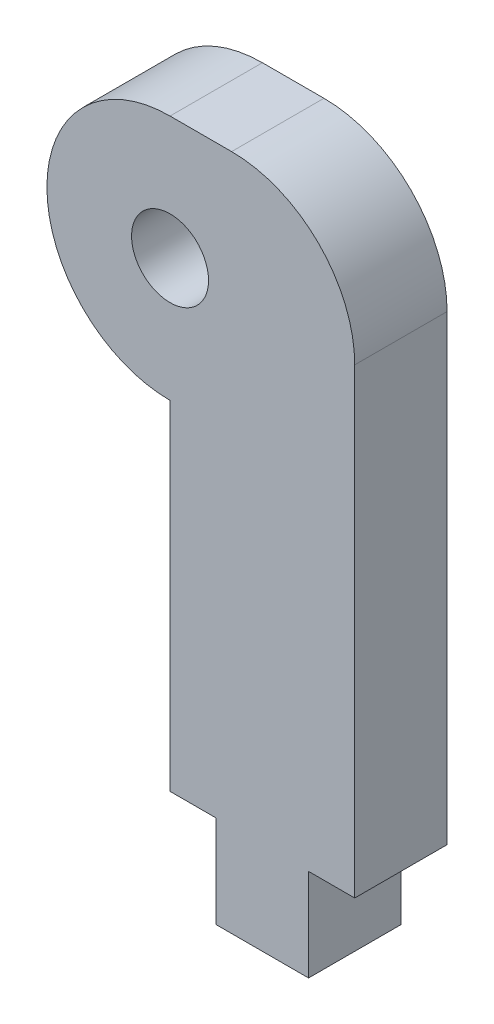
ISO-10303-21;
HEADER;
FILE_DESCRIPTION(('STEP AP214'),'2;1');
FILE_NAME('part.step','',(''),(''),'','','');
FILE_SCHEMA(('AUTOMOTIVE_DESIGN { 1 0 10303 214 1 1 1 1 }'));
ENDSEC;
DATA;
#1=APPLICATION_CONTEXT('core data for automotive mechanical design processes');
#2=APPLICATION_PROTOCOL_DEFINITION('international standard','automotive_design',2000,#1);
#3=PRODUCT_CONTEXT('',#1,'mechanical');
#4=PRODUCT('Part','Part','',(#3));
#5=PRODUCT_RELATED_PRODUCT_CATEGORY('part','',(#4));
#6=PRODUCT_DEFINITION_FORMATION('','',#4);
#7=PRODUCT_DEFINITION_CONTEXT('part definition',#1,'design');
#8=PRODUCT_DEFINITION('design','',#6,#7);
#9=PRODUCT_DEFINITION_SHAPE('','',#8);
#10=(LENGTH_UNIT() NAMED_UNIT(*) SI_UNIT(.MILLI.,.METRE.));
#11=(NAMED_UNIT(*) PLANE_ANGLE_UNIT() SI_UNIT($,.RADIAN.));
#12=(NAMED_UNIT(*) SI_UNIT($,.STERADIAN.) SOLID_ANGLE_UNIT());
#13=UNCERTAINTY_MEASURE_WITH_UNIT(LENGTH_MEASURE(1.E-05),#10,'distance_accuracy_value','');
#14=(GEOMETRIC_REPRESENTATION_CONTEXT(3) GLOBAL_UNCERTAINTY_ASSIGNED_CONTEXT((#13)) GLOBAL_UNIT_ASSIGNED_CONTEXT((#10,
#11,#12)) REPRESENTATION_CONTEXT('',''));
#15=CARTESIAN_POINT('',(0.,0.,0.));
#16=DIRECTION('',(0.,0.,1.));
#17=DIRECTION('',(1.,0.,0.));
#18=AXIS2_PLACEMENT_3D('',#15,#16,#17);
#19=CARTESIAN_POINT('',(0.,0.,3.));
#20=DIRECTION('',(0.,0.,1.));
#21=DIRECTION('',(1.,0.,0.));
#22=AXIS2_PLACEMENT_3D('',#19,#20,#21);
#23=PLANE('',#22);
#24=DIRECTION('',(0.,1.,0.));
#25=VECTOR('',#24,1.);
#26=CARTESIAN_POINT('',(6.,4.,3.));
#27=LINE('',#26,#25);
#28=CARTESIAN_POINT('',(6.00000000000001,-15.,3.));
#29=VERTEX_POINT('',#28);
#30=CARTESIAN_POINT('',(6.,0.,3.));
#31=VERTEX_POINT('',#30);
#32=EDGE_CURVE('E106',#29,#31,#27,.T.);
#33=ORIENTED_EDGE('',*,*,#32,.T.);
#34=CARTESIAN_POINT('',(2.,0.,3.));
#35=DIRECTION('',(0.,0.,1.));
#36=DIRECTION('',(1.,0.,0.));
#37=AXIS2_PLACEMENT_3D('',#34,#35,#36);
#38=CIRCLE('',#37,4.);
#39=CARTESIAN_POINT('',(2.,4.,3.));
#40=VERTEX_POINT('',#39);
#41=EDGE_CURVE('E11',#31,#40,#38,.T.);
#42=ORIENTED_EDGE('',*,*,#41,.T.);
#43=DIRECTION('',(-1.,0.,0.));
#44=VECTOR('',#43,1.);
#45=CARTESIAN_POINT('',(0.,4.,3.));
#46=LINE('',#45,#44);
#47=CARTESIAN_POINT('',(0.,4.,3.));
#48=VERTEX_POINT('',#47);
#49=EDGE_CURVE('E114',#40,#48,#46,.T.);
#50=ORIENTED_EDGE('',*,*,#49,.T.);
#51=CARTESIAN_POINT('',(0.,0.,3.));
#52=DIRECTION('',(0.,0.,1.));
#53=DIRECTION('',(1.,0.,0.));
#54=AXIS2_PLACEMENT_3D('',#51,#52,#53);
#55=CIRCLE('',#54,4.);
#56=CARTESIAN_POINT('',(0.,-4.,3.));
#57=VERTEX_POINT('',#56);
#58=EDGE_CURVE('E181',#48,#57,#55,.T.);
#59=ORIENTED_EDGE('',*,*,#58,.T.);
#60=DIRECTION('',(0.,-1.,0.));
#61=VECTOR('',#60,1.);
#62=CARTESIAN_POINT('',(0.,-15.,3.));
#63=LINE('',#62,#61);
#64=CARTESIAN_POINT('',(0.,-15.,3.));
#65=VERTEX_POINT('',#64);
#66=EDGE_CURVE('E179',#57,#65,#63,.T.);
#67=ORIENTED_EDGE('',*,*,#66,.T.);
#68=DIRECTION('',(1.,0.,0.));
#69=VECTOR('',#68,1.);
#70=CARTESIAN_POINT('',(1.50000000000001,-15.,3.));
#71=LINE('',#70,#69);
#72=CARTESIAN_POINT('',(1.50000000000001,-15.,3.));
#73=VERTEX_POINT('',#72);
#74=EDGE_CURVE('E177',#65,#73,#71,.T.);
#75=ORIENTED_EDGE('',*,*,#74,.T.);
#76=DIRECTION('',(0.,-1.,0.));
#77=VECTOR('',#76,1.);
#78=CARTESIAN_POINT('',(1.50000000000001,-18.,3.));
#79=LINE('',#78,#77);
#80=CARTESIAN_POINT('',(1.50000000000001,-18.,3.));
#81=VERTEX_POINT('',#80);
#82=EDGE_CURVE('E175',#73,#81,#79,.T.);
#83=ORIENTED_EDGE('',*,*,#82,.T.);
#84=DIRECTION('',(1.,0.,0.));
#85=VECTOR('',#84,1.);
#86=CARTESIAN_POINT('',(4.50000000000001,-18.,3.));
#87=LINE('',#86,#85);
#88=CARTESIAN_POINT('',(4.50000000000001,-18.,3.));
#89=VERTEX_POINT('',#88);
#90=EDGE_CURVE('E173',#81,#89,#87,.T.);
#91=ORIENTED_EDGE('',*,*,#90,.T.);
#92=DIRECTION('',(0.,1.,0.));
#93=VECTOR('',#92,1.);
#94=CARTESIAN_POINT('',(4.50000000000001,-15.,3.));
#95=LINE('',#94,#93);
#96=CARTESIAN_POINT('',(4.50000000000001,-15.,3.));
#97=VERTEX_POINT('',#96);
#98=EDGE_CURVE('E120',#89,#97,#95,.T.);
#99=ORIENTED_EDGE('',*,*,#98,.T.);
#100=DIRECTION('',(1.,0.,0.));
#101=VECTOR('',#100,1.);
#102=CARTESIAN_POINT('',(6.00000000000001,-15.,3.));
#103=LINE('',#102,#101);
#104=EDGE_CURVE('E115',#97,#29,#103,.T.);
#105=ORIENTED_EDGE('',*,*,#104,.T.);
#106=EDGE_LOOP('',(#33,#42,#50,#59,#67,#75,#83,#91,#99,#105));
#107=FACE_BOUND('',#106,.T.);
#108=CARTESIAN_POINT('',(0.,0.,3.));
#109=DIRECTION('',(0.,0.,1.));
#110=DIRECTION('',(1.,0.,0.));
#111=AXIS2_PLACEMENT_3D('',#108,#109,#110);
#112=CIRCLE('',#111,1.25);
#113=CARTESIAN_POINT('',(1.25,0.,3.));
#114=VERTEX_POINT('',#113);
#115=EDGE_CURVE('E171',#114,#114,#112,.T.);
#116=ORIENTED_EDGE('',*,*,#115,.F.);
#117=EDGE_LOOP('',(#116));
#118=FACE_BOUND('',#117,.T.);
#119=ADVANCED_FACE('F33',(#107,#118),#23,.T.);
#120=CARTESIAN_POINT('',(0.,0.,0.));
#121=DIRECTION('',(0.,0.,1.));
#122=DIRECTION('',(1.,0.,0.));
#123=AXIS2_PLACEMENT_3D('',#120,#121,#122);
#124=PLANE('',#123);
#125=DIRECTION('',(-1.,0.,0.));
#126=VECTOR('',#125,1.);
#127=CARTESIAN_POINT('',(0.,4.,0.));
#128=LINE('',#127,#126);
#129=CARTESIAN_POINT('',(2.,4.,0.));
#130=VERTEX_POINT('',#129);
#131=CARTESIAN_POINT('',(0.,4.,0.));
#132=VERTEX_POINT('',#131);
#133=EDGE_CURVE('E166',#130,#132,#128,.T.);
#134=ORIENTED_EDGE('',*,*,#133,.F.);
#135=CARTESIAN_POINT('',(2.,0.,0.));
#136=DIRECTION('',(0.,0.,1.));
#137=DIRECTION('',(1.,0.,0.));
#138=AXIS2_PLACEMENT_3D('',#135,#136,#137);
#139=CIRCLE('',#138,4.);
#140=CARTESIAN_POINT('',(6.,0.,0.));
#141=VERTEX_POINT('',#140);
#142=EDGE_CURVE('E55',#130,#141,#139,.F.);
#143=ORIENTED_EDGE('',*,*,#142,.T.);
#144=DIRECTION('',(0.,1.,0.));
#145=VECTOR('',#144,1.);
#146=CARTESIAN_POINT('',(6.,4.,0.));
#147=LINE('',#146,#145);
#148=CARTESIAN_POINT('',(6.00000000000001,-15.,0.));
#149=VERTEX_POINT('',#148);
#150=EDGE_CURVE('E168',#149,#141,#147,.T.);
#151=ORIENTED_EDGE('',*,*,#150,.F.);
#152=DIRECTION('',(1.,0.,0.));
#153=VECTOR('',#152,1.);
#154=CARTESIAN_POINT('',(6.00000000000001,-15.,0.));
#155=LINE('',#154,#153);
#156=CARTESIAN_POINT('',(4.50000000000001,-15.,0.));
#157=VERTEX_POINT('',#156);
#158=EDGE_CURVE('E128',#157,#149,#155,.T.);
#159=ORIENTED_EDGE('',*,*,#158,.F.);
#160=DIRECTION('',(0.,1.,0.));
#161=VECTOR('',#160,1.);
#162=CARTESIAN_POINT('',(4.50000000000001,-15.,0.));
#163=LINE('',#162,#161);
#164=CARTESIAN_POINT('',(4.50000000000001,-18.,0.));
#165=VERTEX_POINT('',#164);
#166=EDGE_CURVE('E124',#165,#157,#163,.T.);
#167=ORIENTED_EDGE('',*,*,#166,.F.);
#168=DIRECTION('',(1.,0.,0.));
#169=VECTOR('',#168,1.);
#170=CARTESIAN_POINT('',(4.50000000000001,-18.,0.));
#171=LINE('',#170,#169);
#172=CARTESIAN_POINT('',(1.50000000000001,-18.,0.));
#173=VERTEX_POINT('',#172);
#174=EDGE_CURVE('E156',#173,#165,#171,.T.);
#175=ORIENTED_EDGE('',*,*,#174,.F.);
#176=DIRECTION('',(0.,-1.,0.));
#177=VECTOR('',#176,1.);
#178=CARTESIAN_POINT('',(1.50000000000001,-18.,0.));
#179=LINE('',#178,#177);
#180=CARTESIAN_POINT('',(1.50000000000001,-15.,0.));
#181=VERTEX_POINT('',#180);
#182=EDGE_CURVE('E158',#181,#173,#179,.T.);
#183=ORIENTED_EDGE('',*,*,#182,.F.);
#184=DIRECTION('',(1.,0.,0.));
#185=VECTOR('',#184,1.);
#186=CARTESIAN_POINT('',(1.50000000000001,-15.,0.));
#187=LINE('',#186,#185);
#188=CARTESIAN_POINT('',(0.,-15.,0.));
#189=VERTEX_POINT('',#188);
#190=EDGE_CURVE('E160',#189,#181,#187,.T.);
#191=ORIENTED_EDGE('',*,*,#190,.F.);
#192=DIRECTION('',(0.,-1.,0.));
#193=VECTOR('',#192,1.);
#194=CARTESIAN_POINT('',(0.,-15.,0.));
#195=LINE('',#194,#193);
#196=CARTESIAN_POINT('',(0.,-4.,0.));
#197=VERTEX_POINT('',#196);
#198=EDGE_CURVE('E162',#197,#189,#195,.T.);
#199=ORIENTED_EDGE('',*,*,#198,.F.);
#200=CARTESIAN_POINT('',(0.,0.,0.));
#201=DIRECTION('',(0.,0.,1.));
#202=DIRECTION('',(1.,0.,0.));
#203=AXIS2_PLACEMENT_3D('',#200,#201,#202);
#204=CIRCLE('',#203,4.);
#205=EDGE_CURVE('E164',#132,#197,#204,.T.);
#206=ORIENTED_EDGE('',*,*,#205,.F.);
#207=EDGE_LOOP('',(#134,#143,#151,#159,#167,#175,#183,#191,#199,#206));
#208=FACE_BOUND('',#207,.T.);
#209=CARTESIAN_POINT('',(0.,0.,0.));
#210=DIRECTION('',(0.,0.,1.));
#211=DIRECTION('',(1.,0.,0.));
#212=AXIS2_PLACEMENT_3D('',#209,#210,#211);
#213=CIRCLE('',#212,1.25);
#214=CARTESIAN_POINT('',(1.25,0.,0.));
#215=VERTEX_POINT('',#214);
#216=EDGE_CURVE('E184',#215,#215,#213,.T.);
#217=ORIENTED_EDGE('',*,*,#216,.T.);
#218=EDGE_LOOP('',(#217));
#219=FACE_BOUND('',#218,.T.);
#220=ADVANCED_FACE('F193',(#208,#219),#124,.F.);
#221=CARTESIAN_POINT('',(6.00000000000001,-15.,3.));
#222=DIRECTION('',(0.,1.,0.));
#223=DIRECTION('',(-1.,0.,0.));
#224=AXIS2_PLACEMENT_3D('',#221,#222,#223);
#225=PLANE('',#224);
#226=ORIENTED_EDGE('',*,*,#158,.T.);
#227=DIRECTION('',(0.,0.,-1.));
#228=VECTOR('',#227,1.);
#229=CARTESIAN_POINT('',(6.00000000000001,-15.,3.));
#230=LINE('',#229,#228);
#231=EDGE_CURVE('E110',#29,#149,#230,.T.);
#232=ORIENTED_EDGE('',*,*,#231,.F.);
#233=ORIENTED_EDGE('',*,*,#104,.F.);
#234=DIRECTION('',(0.,0.,-1.));
#235=VECTOR('',#234,1.);
#236=CARTESIAN_POINT('',(4.50000000000001,-15.,3.));
#237=LINE('',#236,#235);
#238=EDGE_CURVE('E153',#97,#157,#237,.T.);
#239=ORIENTED_EDGE('',*,*,#238,.T.);
#240=EDGE_LOOP('',(#226,#232,#233,#239));
#241=FACE_BOUND('',#240,.T.);
#242=ADVANCED_FACE('F126',(#241),#225,.F.);
#243=CARTESIAN_POINT('',(6.,4.,3.));
#244=DIRECTION('',(-1.,0.,0.));
#245=DIRECTION('',(0.,-1.,0.));
#246=AXIS2_PLACEMENT_3D('',#243,#244,#245);
#247=PLANE('',#246);
#248=ORIENTED_EDGE('',*,*,#150,.T.);
#249=DIRECTION('',(0.,0.,-1.));
#250=VECTOR('',#249,1.);
#251=CARTESIAN_POINT('',(6.,0.,3.));
#252=LINE('',#251,#250);
#253=EDGE_CURVE('E41',#141,#31,#252,.F.);
#254=ORIENTED_EDGE('',*,*,#253,.T.);
#255=ORIENTED_EDGE('',*,*,#32,.F.);
#256=ORIENTED_EDGE('',*,*,#231,.T.);
#257=EDGE_LOOP('',(#248,#254,#255,#256));
#258=FACE_BOUND('',#257,.T.);
#259=ADVANCED_FACE('F108',(#258),#247,.F.);
#260=CARTESIAN_POINT('',(0.,4.,3.));
#261=DIRECTION('',(0.,-1.,0.));
#262=DIRECTION('',(0.,0.,-1.));
#263=AXIS2_PLACEMENT_3D('',#260,#261,#262);
#264=PLANE('',#263);
#265=ORIENTED_EDGE('',*,*,#49,.F.);
#266=DIRECTION('',(0.,0.,-1.));
#267=VECTOR('',#266,1.);
#268=CARTESIAN_POINT('',(2.,4.,3.));
#269=LINE('',#268,#267);
#270=EDGE_CURVE('E129',#40,#130,#269,.T.);
#271=ORIENTED_EDGE('',*,*,#270,.T.);
#272=ORIENTED_EDGE('',*,*,#133,.T.);
#273=DIRECTION('',(0.,0.,-1.));
#274=VECTOR('',#273,1.);
#275=CARTESIAN_POINT('',(0.,4.,3.));
#276=LINE('',#275,#274);
#277=EDGE_CURVE('E130',#48,#132,#276,.T.);
#278=ORIENTED_EDGE('',*,*,#277,.F.);
#279=EDGE_LOOP('',(#265,#271,#272,#278));
#280=FACE_BOUND('',#279,.T.);
#281=ADVANCED_FACE('F224',(#280),#264,.F.);
#282=CARTESIAN_POINT('',(0.,0.,3.));
#283=DIRECTION('',(0.,0.,-1.));
#284=DIRECTION('',(-1.,0.,0.));
#285=AXIS2_PLACEMENT_3D('',#282,#283,#284);
#286=CYLINDRICAL_SURFACE('',#285,4.);
#287=ORIENTED_EDGE('',*,*,#205,.T.);
#288=DIRECTION('',(0.,0.,-1.));
#289=VECTOR('',#288,1.);
#290=CARTESIAN_POINT('',(0.,-4.,3.));
#291=LINE('',#290,#289);
#292=EDGE_CURVE('E135',#57,#197,#291,.T.);
#293=ORIENTED_EDGE('',*,*,#292,.F.);
#294=ORIENTED_EDGE('',*,*,#58,.F.);
#295=ORIENTED_EDGE('',*,*,#277,.T.);
#296=EDGE_LOOP('',(#287,#293,#294,#295));
#297=FACE_BOUND('',#296,.T.);
#298=ADVANCED_FACE('F220',(#297),#286,.T.);
#299=CARTESIAN_POINT('',(0.,-15.,3.));
#300=DIRECTION('',(1.,0.,0.));
#301=DIRECTION('',(0.,1.,0.));
#302=AXIS2_PLACEMENT_3D('',#299,#300,#301);
#303=PLANE('',#302);
#304=ORIENTED_EDGE('',*,*,#198,.T.);
#305=DIRECTION('',(0.,0.,-1.));
#306=VECTOR('',#305,1.);
#307=CARTESIAN_POINT('',(0.,-15.,3.));
#308=LINE('',#307,#306);
#309=EDGE_CURVE('E141',#65,#189,#308,.T.);
#310=ORIENTED_EDGE('',*,*,#309,.F.);
#311=ORIENTED_EDGE('',*,*,#66,.F.);
#312=ORIENTED_EDGE('',*,*,#292,.T.);
#313=EDGE_LOOP('',(#304,#310,#311,#312));
#314=FACE_BOUND('',#313,.T.);
#315=ADVANCED_FACE('F216',(#314),#303,.F.);
#316=CARTESIAN_POINT('',(1.50000000000001,-15.,3.));
#317=DIRECTION('',(0.,1.,0.));
#318=DIRECTION('',(0.,0.,1.));
#319=AXIS2_PLACEMENT_3D('',#316,#317,#318);
#320=PLANE('',#319);
#321=ORIENTED_EDGE('',*,*,#190,.T.);
#322=DIRECTION('',(0.,0.,-1.));
#323=VECTOR('',#322,1.);
#324=CARTESIAN_POINT('',(1.50000000000001,-15.,3.));
#325=LINE('',#324,#323);
#326=EDGE_CURVE('E144',#73,#181,#325,.T.);
#327=ORIENTED_EDGE('',*,*,#326,.F.);
#328=ORIENTED_EDGE('',*,*,#74,.F.);
#329=ORIENTED_EDGE('',*,*,#309,.T.);
#330=EDGE_LOOP('',(#321,#327,#328,#329));
#331=FACE_BOUND('',#330,.T.);
#332=ADVANCED_FACE('F212',(#331),#320,.F.);
#333=CARTESIAN_POINT('',(1.50000000000001,-18.,3.));
#334=DIRECTION('',(1.,0.,0.));
#335=DIRECTION('',(0.,0.,-1.));
#336=AXIS2_PLACEMENT_3D('',#333,#334,#335);
#337=PLANE('',#336);
#338=ORIENTED_EDGE('',*,*,#182,.T.);
#339=DIRECTION('',(0.,0.,-1.));
#340=VECTOR('',#339,1.);
#341=CARTESIAN_POINT('',(1.50000000000001,-18.,3.));
#342=LINE('',#341,#340);
#343=EDGE_CURVE('E147',#81,#173,#342,.T.);
#344=ORIENTED_EDGE('',*,*,#343,.F.);
#345=ORIENTED_EDGE('',*,*,#82,.F.);
#346=ORIENTED_EDGE('',*,*,#326,.T.);
#347=EDGE_LOOP('',(#338,#344,#345,#346));
#348=FACE_BOUND('',#347,.T.);
#349=ADVANCED_FACE('F208',(#348),#337,.F.);
#350=CARTESIAN_POINT('',(4.50000000000001,-18.,3.));
#351=DIRECTION('',(0.,1.,0.));
#352=DIRECTION('',(0.,0.,1.));
#353=AXIS2_PLACEMENT_3D('',#350,#351,#352);
#354=PLANE('',#353);
#355=ORIENTED_EDGE('',*,*,#174,.T.);
#356=DIRECTION('',(0.,0.,-1.));
#357=VECTOR('',#356,1.);
#358=CARTESIAN_POINT('',(4.50000000000001,-18.,3.));
#359=LINE('',#358,#357);
#360=EDGE_CURVE('E150',#89,#165,#359,.T.);
#361=ORIENTED_EDGE('',*,*,#360,.F.);
#362=ORIENTED_EDGE('',*,*,#90,.F.);
#363=ORIENTED_EDGE('',*,*,#343,.T.);
#364=EDGE_LOOP('',(#355,#361,#362,#363));
#365=FACE_BOUND('',#364,.T.);
#366=ADVANCED_FACE('F204',(#365),#354,.F.);
#367=CARTESIAN_POINT('',(4.50000000000001,-15.,3.));
#368=DIRECTION('',(-1.,0.,0.));
#369=DIRECTION('',(0.,-1.,0.));
#370=AXIS2_PLACEMENT_3D('',#367,#368,#369);
#371=PLANE('',#370);
#372=ORIENTED_EDGE('',*,*,#166,.T.);
#373=ORIENTED_EDGE('',*,*,#238,.F.);
#374=ORIENTED_EDGE('',*,*,#98,.F.);
#375=ORIENTED_EDGE('',*,*,#360,.T.);
#376=EDGE_LOOP('',(#372,#373,#374,#375));
#377=FACE_BOUND('',#376,.T.);
#378=ADVANCED_FACE('F201',(#377),#371,.F.);
#379=CARTESIAN_POINT('',(0.,0.,3.));
#380=DIRECTION('',(0.,0.,-1.));
#381=DIRECTION('',(-1.,0.,0.));
#382=AXIS2_PLACEMENT_3D('',#379,#380,#381);
#383=CYLINDRICAL_SURFACE('',#382,1.25);
#384=ORIENTED_EDGE('',*,*,#115,.T.);
#385=EDGE_LOOP('',(#384));
#386=FACE_BOUND('',#385,.T.);
#387=ORIENTED_EDGE('',*,*,#216,.F.);
#388=EDGE_LOOP('',(#387));
#389=FACE_BOUND('',#388,.T.);
#390=ADVANCED_FACE('F190',(#386,#389),#383,.F.);
#391=CARTESIAN_POINT('',(2.,0.,3.));
#392=DIRECTION('',(0.,0.,-1.));
#393=DIRECTION('',(-1.,0.,0.));
#394=AXIS2_PLACEMENT_3D('',#391,#392,#393);
#395=CYLINDRICAL_SURFACE('',#394,4.);
#396=ORIENTED_EDGE('',*,*,#41,.F.);
#397=ORIENTED_EDGE('',*,*,#253,.F.);
#398=ORIENTED_EDGE('',*,*,#142,.F.);
#399=ORIENTED_EDGE('',*,*,#270,.F.);
#400=EDGE_LOOP('',(#396,#397,#398,#399));
#401=FACE_BOUND('',#400,.T.);
#402=ADVANCED_FACE('F35',(#401),#395,.T.);
#403=CLOSED_SHELL('',(#119,#220,#242,#259,#281,#298,#315,#332,#349,#366,#378,#390,#402));
#404=MANIFOLD_SOLID_BREP('B2',#403);
#405=ADVANCED_BREP_SHAPE_REPRESENTATION('',(#18,#404),#14);
#406=SHAPE_DEFINITION_REPRESENTATION(#9,#405);
ENDSEC;
END-ISO-10303-21;
